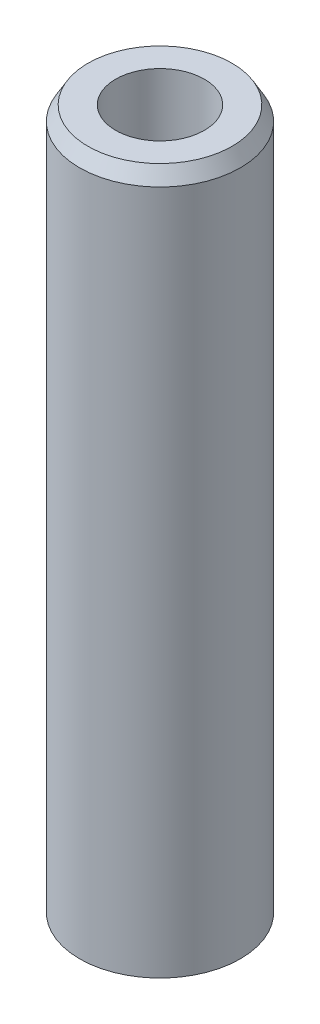
ISO-10303-21;
HEADER;
FILE_DESCRIPTION(('STEP AP214'),'2;1');
FILE_NAME('part.step','',(''),(''),'','','');
FILE_SCHEMA(('AUTOMOTIVE_DESIGN { 1 0 10303 214 1 1 1 1 }'));
ENDSEC;
DATA;
#1=APPLICATION_CONTEXT('core data for automotive mechanical design processes');
#2=APPLICATION_PROTOCOL_DEFINITION('international standard','automotive_design',2000,#1);
#3=PRODUCT_CONTEXT('',#1,'mechanical');
#4=PRODUCT('Part','Part','',(#3));
#5=PRODUCT_RELATED_PRODUCT_CATEGORY('part','',(#4));
#6=PRODUCT_DEFINITION_FORMATION('','',#4);
#7=PRODUCT_DEFINITION_CONTEXT('part definition',#1,'design');
#8=PRODUCT_DEFINITION('design','',#6,#7);
#9=PRODUCT_DEFINITION_SHAPE('','',#8);
#10=(LENGTH_UNIT() NAMED_UNIT(*) SI_UNIT(.MILLI.,.METRE.));
#11=(NAMED_UNIT(*) PLANE_ANGLE_UNIT() SI_UNIT($,.RADIAN.));
#12=(NAMED_UNIT(*) SI_UNIT($,.STERADIAN.) SOLID_ANGLE_UNIT());
#13=UNCERTAINTY_MEASURE_WITH_UNIT(LENGTH_MEASURE(1.E-05),#10,'distance_accuracy_value','');
#14=(GEOMETRIC_REPRESENTATION_CONTEXT(3) GLOBAL_UNCERTAINTY_ASSIGNED_CONTEXT((#13)) GLOBAL_UNIT_ASSIGNED_CONTEXT((#10,
#11,#12)) REPRESENTATION_CONTEXT('',''));
#15=CARTESIAN_POINT('',(0.,0.,0.));
#16=DIRECTION('',(0.,0.,1.));
#17=DIRECTION('',(1.,0.,0.));
#18=AXIS2_PLACEMENT_3D('',#15,#16,#17);
#19=CARTESIAN_POINT('',(0.,110.078650768655,0.));
#20=DIRECTION('',(0.,-1.,0.));
#21=DIRECTION('',(0.,0.,-1.));
#22=AXIS2_PLACEMENT_3D('',#19,#20,#21);
#23=CYLINDRICAL_SURFACE('',#22,12.5);
#24=CARTESIAN_POINT('',(0.,107.832440555177,0.));
#25=DIRECTION('',(0.,1.,0.));
#26=DIRECTION('',(0.,0.,1.));
#27=AXIS2_PLACEMENT_3D('',#24,#25,#26);
#28=CIRCLE('',#27,12.5);
#29=CARTESIAN_POINT('',(0.,107.832440555177,-12.5));
#30=VERTEX_POINT('',#29);
#31=EDGE_CURVE('E50',#30,#30,#28,.F.);
#32=CARTESIAN_POINT('',(0.,1.2968500714078,0.));
#33=DIRECTION('',(0.,1.,0.));
#34=DIRECTION('',(0.,0.,1.));
#35=AXIS2_PLACEMENT_3D('',#32,#33,#34);
#36=CIRCLE('',#35,12.5);
#37=CARTESIAN_POINT('',(0.,1.2968500714078,-12.5));
#38=VERTEX_POINT('',#37);
#39=EDGE_CURVE('E51',#38,#38,#36,.T.);
#40=CARTESIAN_POINT('',(0.,107.832440555177,-12.5));
#41=CARTESIAN_POINT('',(0.,106.722694820972,-12.5));
#42=CARTESIAN_POINT('',(0.,105.612949086766,-12.5));
#43=CARTESIAN_POINT('',(0.,103.393457618354,-12.5));
#44=CARTESIAN_POINT('',(0.,102.283711884148,-12.5));
#45=CARTESIAN_POINT('',(0.,100.064220415736,-12.5));
#46=CARTESIAN_POINT('',(0.,98.95447468153,-12.5));
#47=CARTESIAN_POINT('',(0.,96.7349832131182,-12.5));
#48=CARTESIAN_POINT('',(0.,95.6252374789122,-12.5));
#49=CARTESIAN_POINT('',(0.,93.4057460105004,-12.5));
#50=CARTESIAN_POINT('',(0.,92.2960002762944,-12.5));
#51=CARTESIAN_POINT('',(0.,90.0765088078825,-12.5));
#52=CARTESIAN_POINT('',(0.,88.9667630736766,-12.5));
#53=CARTESIAN_POINT('',(0.,86.7472716052647,-12.5));
#54=CARTESIAN_POINT('',(0.,85.6375258710588,-12.5));
#55=CARTESIAN_POINT('',(0.,83.418034402647,-12.5));
#56=CARTESIAN_POINT('',(0.,82.308288668441,-12.5));
#57=CARTESIAN_POINT('',(0.,80.0887972000291,-12.5));
#58=CARTESIAN_POINT('',(0.,78.9790514658232,-12.5));
#59=CARTESIAN_POINT('',(0.,76.7595599974113,-12.5));
#60=CARTESIAN_POINT('',(0.,75.6498142632054,-12.5));
#61=CARTESIAN_POINT('',(0.,73.4303227947935,-12.5));
#62=CARTESIAN_POINT('',(0.,72.3205770605876,-12.5));
#63=CARTESIAN_POINT('',(0.,70.1010855921757,-12.5));
#64=CARTESIAN_POINT('',(0.,68.9913398579698,-12.5));
#65=CARTESIAN_POINT('',(0.,66.7718483895579,-12.5));
#66=CARTESIAN_POINT('',(0.,65.662102655352,-12.5));
#67=CARTESIAN_POINT('',(0.,63.4426111869401,-12.5));
#68=CARTESIAN_POINT('',(0.,62.3328654527342,-12.5));
#69=CARTESIAN_POINT('',(0.,60.1133739843223,-12.5));
#70=CARTESIAN_POINT('',(0.,59.0036282501164,-12.5));
#71=CARTESIAN_POINT('',(0.,56.7841367817045,-12.5));
#72=CARTESIAN_POINT('',(0.,55.6743910474986,-12.5));
#73=CARTESIAN_POINT('',(0.,53.4548995790867,-12.5));
#74=CARTESIAN_POINT('',(0.,52.3451538448808,-12.5));
#75=CARTESIAN_POINT('',(0.,50.1256623764689,-12.5));
#76=CARTESIAN_POINT('',(0.,49.015916642263,-12.5));
#77=CARTESIAN_POINT('',(0.,46.7964251738511,-12.5));
#78=CARTESIAN_POINT('',(0.,45.6866794396452,-12.5));
#79=CARTESIAN_POINT('',(0.,43.4671879712333,-12.5));
#80=CARTESIAN_POINT('',(0.,42.3574422370274,-12.5));
#81=CARTESIAN_POINT('',(0.,40.1379507686155,-12.5));
#82=CARTESIAN_POINT('',(0.,39.0282050344096,-12.5));
#83=CARTESIAN_POINT('',(0.,36.8087135659977,-12.5));
#84=CARTESIAN_POINT('',(0.,35.6989678317918,-12.5));
#85=CARTESIAN_POINT('',(0.,33.4794763633799,-12.5));
#86=CARTESIAN_POINT('',(0.,32.369730629174,-12.5));
#87=CARTESIAN_POINT('',(0.,30.1502391607621,-12.5));
#88=CARTESIAN_POINT('',(0.,29.0404934265562,-12.5));
#89=CARTESIAN_POINT('',(0.,26.8210019581443,-12.5));
#90=CARTESIAN_POINT('',(0.,25.7112562239384,-12.5));
#91=CARTESIAN_POINT('',(0.,23.4917647555265,-12.5));
#92=CARTESIAN_POINT('',(0.,22.3820190213206,-12.5));
#93=CARTESIAN_POINT('',(0.,20.1625275529087,-12.5));
#94=CARTESIAN_POINT('',(0.,19.0527818187027,-12.5));
#95=CARTESIAN_POINT('',(0.,16.8332903502909,-12.5));
#96=CARTESIAN_POINT('',(0.,15.7235446160849,-12.5));
#97=CARTESIAN_POINT('',(0.,13.5040531476731,-12.5));
#98=CARTESIAN_POINT('',(0.,12.3943074134671,-12.5));
#99=CARTESIAN_POINT('',(0.,10.1748159450553,-12.5));
#100=CARTESIAN_POINT('',(0.,9.06507021084935,-12.5));
#101=CARTESIAN_POINT('',(0.,6.84557874243748,-12.5));
#102=CARTESIAN_POINT('',(0.,5.73583300823153,-12.5));
#103=CARTESIAN_POINT('',(0.,3.51634153981966,-12.5));
#104=CARTESIAN_POINT('',(0.,2.40659580561373,-12.5));
#105=CARTESIAN_POINT('',(0.,1.2968500714078,-12.5));
#106=B_SPLINE_CURVE_WITH_KNOTS('',3,(#40,#41,#42,#43,#44,#45,#46,#47,#48,#49,#50,#51,#52,#53,
#54,#55,#56,#57,#58,#59,#60,#61,#62,#63,#64,#65,#66,#67,#68,#69,#70,#71,#72,#73,#74,#75,#76,#77,
#78,#79,#80,#81,#82,#83,#84,#85,#86,#87,#88,#89,#90,#91,#92,#93,#94,#95,#96,#97,#98,#99,#100,
#101,#102,#103,#104,#105),.UNSPECIFIED.,.F.,.F.,(4,2,2,2,2,2,2,2,2,2,2,2,2,2,2,2,2,2,2,2,2,2,2,
2,2,2,2,2,2,2,2,2,4),(0.,3.32923720261781,6.65847440523561,9.98771160785342,13.3169488104712,
16.646186013089,19.9754232157068,23.3046604183246,26.6338976209424,29.9631348235602,
33.292372026178,36.6216092287958,39.9508464314136,43.2800836340314,46.6093208366492,
49.9385580392671,53.2677952418849,56.5970324445027,59.9262696471205,63.2555068497383,
66.5847440523561,69.9139812549739,73.2432184575917,76.5724556602095,79.9016928628273,
83.2309300654451,86.5601672680629,89.8894044706807,93.2186416732985,96.5478788759163,
99.8771160785341,103.206353281152,106.53559048377),.UNSPECIFIED.);
#107=EDGE_CURVE('BSEAM39',#30,#38,#106,.T.);
#108=ORIENTED_EDGE('',*,*,#31,.T.);
#109=ORIENTED_EDGE('',*,*,#39,.T.);
#110=ORIENTED_EDGE('',*,*,#107,.T.);
#111=ORIENTED_EDGE('',*,*,#107,.F.);
#112=EDGE_LOOP('',(#108,#110,#109,#111));
#113=FACE_BOUND('',#112,.T.);
#114=ADVANCED_FACE('F39',(#113),#23,.T.);
#115=CARTESIAN_POINT('',(0.,110.078650768655,0.));
#116=DIRECTION('',(0.,1.,0.));
#117=DIRECTION('',(0.,0.,1.));
#118=AXIS2_PLACEMENT_3D('',#115,#116,#117);
#119=PLANE('',#118);
#120=CARTESIAN_POINT('',(0.,110.078650768655,0.));
#121=DIRECTION('',(0.,1.,0.));
#122=DIRECTION('',(0.,0.,1.));
#123=AXIS2_PLACEMENT_3D('',#120,#121,#122);
#124=CIRCLE('',#123,11.2031499285923);
#125=CARTESIAN_POINT('',(0.,110.078650768655,-11.2031499285923));
#126=VERTEX_POINT('',#125);
#127=EDGE_CURVE('E54',#126,#126,#124,.T.);
#128=ORIENTED_EDGE('',*,*,#127,.T.);
#129=EDGE_LOOP('',(#128));
#130=FACE_BOUND('',#129,.T.);
#131=CARTESIAN_POINT('',(0.,110.078650768655,0.));
#132=DIRECTION('',(0.,1.,0.));
#133=DIRECTION('',(0.,0.,1.));
#134=AXIS2_PLACEMENT_3D('',#131,#132,#133);
#135=CIRCLE('',#134,6.89995657612535);
#136=CARTESIAN_POINT('',(0.,110.078650768655,-6.89995657612535));
#137=VERTEX_POINT('',#136);
#138=EDGE_CURVE('E58',#137,#137,#135,.T.);
#139=ORIENTED_EDGE('',*,*,#138,.F.);
#140=EDGE_LOOP('',(#139));
#141=FACE_BOUND('',#140,.T.);
#142=ADVANCED_FACE('F69',(#130,#141),#119,.T.);
#143=CARTESIAN_POINT('',(0.,0.,0.));
#144=DIRECTION('',(0.,1.,0.));
#145=DIRECTION('',(0.,0.,1.));
#146=AXIS2_PLACEMENT_3D('',#143,#144,#145);
#147=PLANE('',#146);
#148=CARTESIAN_POINT('',(0.,0.,0.));
#149=DIRECTION('',(0.,1.,0.));
#150=DIRECTION('',(0.,0.,1.));
#151=AXIS2_PLACEMENT_3D('',#148,#149,#150);
#152=CIRCLE('',#151,10.2537897865223);
#153=CARTESIAN_POINT('',(0.,0.,10.2537897865223));
#154=VERTEX_POINT('',#153);
#155=EDGE_CURVE('E10',#154,#154,#152,.F.);
#156=ORIENTED_EDGE('',*,*,#155,.T.);
#157=EDGE_LOOP('',(#156));
#158=FACE_BOUND('',#157,.T.);
#159=CARTESIAN_POINT('',(0.,0.,0.));
#160=DIRECTION('',(0.,1.,0.));
#161=DIRECTION('',(0.,0.,1.));
#162=AXIS2_PLACEMENT_3D('',#159,#160,#161);
#163=CIRCLE('',#162,6.89995657612535);
#164=CARTESIAN_POINT('',(0.,0.,-6.89995657612535));
#165=VERTEX_POINT('',#164);
#166=EDGE_CURVE('E63',#165,#165,#163,.T.);
#167=ORIENTED_EDGE('',*,*,#166,.T.);
#168=EDGE_LOOP('',(#167));
#169=FACE_BOUND('',#168,.T.);
#170=ADVANCED_FACE('F75',(#158,#169),#147,.F.);
#171=CARTESIAN_POINT('',(0.,110.078650768655,0.));
#172=DIRECTION('',(0.,-1.,0.));
#173=DIRECTION('',(0.,0.,-1.));
#174=AXIS2_PLACEMENT_3D('',#171,#172,#173);
#175=CYLINDRICAL_SURFACE('',#174,6.89995657612535);
#176=CARTESIAN_POINT('',(0.,110.078650768655,-6.89995657612535));
#177=CARTESIAN_POINT('',(0.,108.931998156481,-6.89995657612535));
#178=CARTESIAN_POINT('',(0.,107.785345544308,-6.89995657612535));
#179=CARTESIAN_POINT('',(0.,105.492040319961,-6.89995657612535));
#180=CARTESIAN_POINT('',(0.,104.345387707787,-6.89995657612535));
#181=CARTESIAN_POINT('',(0.,102.052082483441,-6.89995657612535));
#182=CARTESIAN_POINT('',(0.,100.905429871267,-6.89995657612535));
#183=CARTESIAN_POINT('',(0.,98.61212464692,-6.89995657612535));
#184=CARTESIAN_POINT('',(0.,97.4654720347466,-6.89995657612535));
#185=CARTESIAN_POINT('',(0.,95.1721668103996,-6.89995657612535));
#186=CARTESIAN_POINT('',(0.,94.0255141982261,-6.89995657612535));
#187=CARTESIAN_POINT('',(0.,91.7322089738791,-6.89995657612535));
#188=CARTESIAN_POINT('',(0.,90.5855563617056,-6.89995657612535));
#189=CARTESIAN_POINT('',(0.,88.2922511373586,-6.89995657612535));
#190=CARTESIAN_POINT('',(0.,87.1455985251852,-6.89995657612535));
#191=CARTESIAN_POINT('',(0.,84.8522933008382,-6.89995657612535));
#192=CARTESIAN_POINT('',(0.,83.7056406886647,-6.89995657612535));
#193=CARTESIAN_POINT('',(0.,81.4123354643177,-6.89995657612535));
#194=CARTESIAN_POINT('',(0.,80.2656828521442,-6.89995657612535));
#195=CARTESIAN_POINT('',(0.,77.9723776277972,-6.89995657612535));
#196=CARTESIAN_POINT('',(0.,76.8257250156237,-6.89995657612535));
#197=CARTESIAN_POINT('',(0.,74.5324197912768,-6.89995657612535));
#198=CARTESIAN_POINT('',(0.,73.3857671791033,-6.89995657612535));
#199=CARTESIAN_POINT('',(0.,71.0924619547563,-6.89995657612535));
#200=CARTESIAN_POINT('',(0.,69.9458093425828,-6.89995657612535));
#201=CARTESIAN_POINT('',(0.,67.6525041182358,-6.89995657612535));
#202=CARTESIAN_POINT('',(0.,66.5058515060624,-6.89995657612535));
#203=CARTESIAN_POINT('',(0.,64.2125462817154,-6.89995657612535));
#204=CARTESIAN_POINT('',(0.,63.0658936695419,-6.89995657612535));
#205=CARTESIAN_POINT('',(0.,60.7725884451949,-6.89995657612535));
#206=CARTESIAN_POINT('',(0.,59.6259358330214,-6.89995657612535));
#207=CARTESIAN_POINT('',(0.,57.3326306086744,-6.89995657612535));
#208=CARTESIAN_POINT('',(0.,56.185977996501,-6.89995657612535));
#209=CARTESIAN_POINT('',(0.,53.892672772154,-6.89995657612535));
#210=CARTESIAN_POINT('',(0.,52.7460201599805,-6.89995657612535));
#211=CARTESIAN_POINT('',(0.,50.4527149356335,-6.89995657612535));
#212=CARTESIAN_POINT('',(0.,49.30606232346,-6.89995657612535));
#213=CARTESIAN_POINT('',(0.,47.012757099113,-6.89995657612535));
#214=CARTESIAN_POINT('',(0.,45.8661044869396,-6.89995657612535));
#215=CARTESIAN_POINT('',(0.,43.5727992625926,-6.89995657612535));
#216=CARTESIAN_POINT('',(0.,42.4261466504191,-6.89995657612535));
#217=CARTESIAN_POINT('',(0.,40.1328414260721,-6.89995657612535));
#218=CARTESIAN_POINT('',(0.,38.9861888138986,-6.89995657612535));
#219=CARTESIAN_POINT('',(0.,36.6928835895516,-6.89995657612535));
#220=CARTESIAN_POINT('',(0.,35.5462309773782,-6.89995657612535));
#221=CARTESIAN_POINT('',(0.,33.2529257530312,-6.89995657612535));
#222=CARTESIAN_POINT('',(0.,32.1062731408577,-6.89995657612535));
#223=CARTESIAN_POINT('',(0.,29.8129679165107,-6.89995657612535));
#224=CARTESIAN_POINT('',(0.,28.6663153043372,-6.89995657612535));
#225=CARTESIAN_POINT('',(0.,26.3730100799902,-6.89995657612535));
#226=CARTESIAN_POINT('',(0.,25.2263574678167,-6.89995657612535));
#227=CARTESIAN_POINT('',(0.,22.9330522434698,-6.89995657612535));
#228=CARTESIAN_POINT('',(0.,21.7863996312963,-6.89995657612535));
#229=CARTESIAN_POINT('',(0.,19.4930944069493,-6.89995657612535));
#230=CARTESIAN_POINT('',(0.,18.3464417947758,-6.89995657612535));
#231=CARTESIAN_POINT('',(0.,16.0531365704288,-6.89995657612535));
#232=CARTESIAN_POINT('',(0.,14.9064839582553,-6.89995657612535));
#233=CARTESIAN_POINT('',(0.,12.6131787339084,-6.89995657612535));
#234=CARTESIAN_POINT('',(0.,11.4665261217349,-6.89995657612535));
#235=CARTESIAN_POINT('',(0.,9.1732208973879,-6.89995657612535));
#236=CARTESIAN_POINT('',(0.,8.02656828521441,-6.89995657612535));
#237=CARTESIAN_POINT('',(0.,5.73326306086744,-6.89995657612535));
#238=CARTESIAN_POINT('',(0.,4.58661044869395,-6.89995657612535));
#239=CARTESIAN_POINT('',(0.,2.29330522434697,-6.89995657612535));
#240=CARTESIAN_POINT('',(0.,1.14665261217348,-6.89995657612535));
#241=CARTESIAN_POINT('',(0.,0.,-6.89995657612535));
#242=B_SPLINE_CURVE_WITH_KNOTS('',3,(#176,#177,#178,#179,#180,#181,#182,#183,#184,#185,#186,
#187,#188,#189,#190,#191,#192,#193,#194,#195,#196,#197,#198,#199,#200,#201,#202,#203,#204,#205,
#206,#207,#208,#209,#210,#211,#212,#213,#214,#215,#216,#217,#218,#219,#220,#221,#222,#223,#224,
#225,#226,#227,#228,#229,#230,#231,#232,#233,#234,#235,#236,#237,#238,#239,#240,#241),
.UNSPECIFIED.,.F.,.F.,(4,2,2,2,2,2,2,2,2,2,2,2,2,2,2,2,2,2,2,2,2,2,2,2,2,2,2,2,2,2,2,2,4),(0.,
3.43995783652047,6.87991567304094,10.3198735095614,13.7598313460819,17.1997891826023,
20.6397470191228,24.0797048556433,27.5196626921637,30.9596205286842,34.3995783652047,
37.8395362017251,41.2794940382456,44.7194518747661,48.1594097112865,51.599367547807,
55.0393253843275,58.479283220848,61.9192410573684,65.3591988938889,68.7991567304094,
72.2391145669298,75.6790724034503,79.1190302399707,82.5589880764912,85.9989459130117,
89.4389037495322,92.8788615860526,96.3188194225731,99.7587772590936,103.198735095614,
106.638692932134,110.078650768655),.UNSPECIFIED.);
#243=EDGE_CURVE('BSEAM70',#137,#165,#242,.T.);
#244=ORIENTED_EDGE('',*,*,#138,.T.);
#245=ORIENTED_EDGE('',*,*,#166,.F.);
#246=ORIENTED_EDGE('',*,*,#243,.T.);
#247=ORIENTED_EDGE('',*,*,#243,.F.);
#248=EDGE_LOOP('',(#244,#246,#245,#247));
#249=FACE_BOUND('',#248,.T.);
#250=ADVANCED_FACE('F70',(#249),#175,.F.);
#251=CARTESIAN_POINT('',(0.,110.078650768655,0.));
#252=DIRECTION('',(0.,-1.,0.));
#253=DIRECTION('',(0.,0.,-1.));
#254=AXIS2_PLACEMENT_3D('',#251,#252,#253);
#255=CONICAL_SURFACE('',#254,11.2031499285923,0.523598775598296);
#256=CARTESIAN_POINT('',(0.,107.832440555177,-12.5));
#257=CARTESIAN_POINT('',(0.,107.855838578235,-12.4864911450895));
#258=CARTESIAN_POINT('',(0.,107.879236601292,-12.472982290179));
#259=CARTESIAN_POINT('',(0.,107.926032647406,-12.445964580358));
#260=CARTESIAN_POINT('',(0.,107.949430670463,-12.4324557254475));
#261=CARTESIAN_POINT('',(0.,107.996226716577,-12.4054380156265));
#262=CARTESIAN_POINT('',(0.,108.019624739634,-12.391929160716));
#263=CARTESIAN_POINT('',(0.,108.066420785748,-12.364911450895));
#264=CARTESIAN_POINT('',(0.,108.089818808805,-12.3514025959845));
#265=CARTESIAN_POINT('',(0.,108.136614854919,-12.3243848861635));
#266=CARTESIAN_POINT('',(0.,108.160012877976,-12.3108760312531));
#267=CARTESIAN_POINT('',(0.,108.20680892409,-12.2838583214321));
#268=CARTESIAN_POINT('',(0.,108.230206947147,-12.2703494665216));
#269=CARTESIAN_POINT('',(0.,108.277002993262,-12.2433317567006));
#270=CARTESIAN_POINT('',(0.,108.300401016319,-12.2298229017901));
#271=CARTESIAN_POINT('',(0.,108.347197062433,-12.2028051919691));
#272=CARTESIAN_POINT('',(0.,108.37059508549,-12.1892963370586));
#273=CARTESIAN_POINT('',(0.,108.417391131604,-12.1622786272376));
#274=CARTESIAN_POINT('',(0.,108.440789154661,-12.1487697723271));
#275=CARTESIAN_POINT('',(0.,108.487585200775,-12.1217520625061));
#276=CARTESIAN_POINT('',(0.,108.510983223832,-12.1082432075956));
#277=CARTESIAN_POINT('',(0.,108.557779269946,-12.0812254977746));
#278=CARTESIAN_POINT('',(0.,108.581177293003,-12.0677166428641));
#279=CARTESIAN_POINT('',(0.,108.627973339117,-12.0406989330431));
#280=CARTESIAN_POINT('',(0.,108.651371362174,-12.0271900781326));
#281=CARTESIAN_POINT('',(0.,108.698167408289,-12.0001723683116));
#282=CARTESIAN_POINT('',(0.,108.721565431346,-11.9866635134011));
#283=CARTESIAN_POINT('',(0.,108.76836147746,-11.9596458035801));
#284=CARTESIAN_POINT('',(0.,108.791759500517,-11.9461369486696));
#285=CARTESIAN_POINT('',(0.,108.838555546631,-11.9191192388486));
#286=CARTESIAN_POINT('',(0.,108.861953569688,-11.9056103839382));
#287=CARTESIAN_POINT('',(0.,108.908749615802,-11.8785926741172));
#288=CARTESIAN_POINT('',(0.,108.932147638859,-11.8650838192067));
#289=CARTESIAN_POINT('',(0.,108.978943684973,-11.8380661093857));
#290=CARTESIAN_POINT('',(0.,109.00234170803,-11.8245572544752));
#291=CARTESIAN_POINT('',(0.,109.049137754144,-11.7975395446542));
#292=CARTESIAN_POINT('',(0.,109.072535777201,-11.7840306897437));
#293=CARTESIAN_POINT('',(0.,109.119331823316,-11.7570129799227));
#294=CARTESIAN_POINT('',(0.,109.142729846373,-11.7435041250122));
#295=CARTESIAN_POINT('',(0.,109.189525892487,-11.7164864151912));
#296=CARTESIAN_POINT('',(0.,109.212923915544,-11.7029775602807));
#297=CARTESIAN_POINT('',(0.,109.259719961658,-11.6759598504597));
#298=CARTESIAN_POINT('',(0.,109.283117984715,-11.6624509955492));
#299=CARTESIAN_POINT('',(0.,109.329914030829,-11.6354332857282));
#300=CARTESIAN_POINT('',(0.,109.353312053886,-11.6219244308177));
#301=CARTESIAN_POINT('',(0.,109.4001081,-11.5949067209967));
#302=CARTESIAN_POINT('',(0.,109.423506123057,-11.5813978660862));
#303=CARTESIAN_POINT('',(0.,109.470302169171,-11.5543801562652));
#304=CARTESIAN_POINT('',(0.,109.493700192229,-11.5408713013547));
#305=CARTESIAN_POINT('',(0.,109.540496238343,-11.5138535915337));
#306=CARTESIAN_POINT('',(0.,109.5638942614,-11.5003447366233));
#307=CARTESIAN_POINT('',(0.,109.610690307514,-11.4733270268023));
#308=CARTESIAN_POINT('',(0.,109.634088330571,-11.4598181718918));
#309=CARTESIAN_POINT('',(0.,109.680884376685,-11.4328004620708));
#310=CARTESIAN_POINT('',(0.,109.704282399742,-11.4192916071603));
#311=CARTESIAN_POINT('',(0.,109.751078445856,-11.3922738973393));
#312=CARTESIAN_POINT('',(0.,109.774476468913,-11.3787650424288));
#313=CARTESIAN_POINT('',(0.,109.821272515027,-11.3517473326078));
#314=CARTESIAN_POINT('',(0.,109.844670538084,-11.3382384776973));
#315=CARTESIAN_POINT('',(0.,109.891466584198,-11.3112207678763));
#316=CARTESIAN_POINT('',(0.,109.914864607256,-11.2977119129658));
#317=CARTESIAN_POINT('',(0.,109.96166065337,-11.2706942031448));
#318=CARTESIAN_POINT('',(0.,109.985058676427,-11.2571853482343));
#319=CARTESIAN_POINT('',(0.,110.031854722541,-11.2301676384133));
#320=CARTESIAN_POINT('',(0.,110.055252745598,-11.2166587835028));
#321=CARTESIAN_POINT('',(0.,110.078650768655,-11.2031499285923));
#322=B_SPLINE_CURVE_WITH_KNOTS('',3,(#256,#257,#258,#259,#260,#261,#262,#263,#264,#265,#266,
#267,#268,#269,#270,#271,#272,#273,#274,#275,#276,#277,#278,#279,#280,#281,#282,#283,#284,#285,
#286,#287,#288,#289,#290,#291,#292,#293,#294,#295,#296,#297,#298,#299,#300,#301,#302,#303,#304,
#305,#306,#307,#308,#309,#310,#311,#312,#313,#314,#315,#316,#317,#318,#319,#320,#321),
.UNSPECIFIED.,.F.,.F.,(4,2,2,2,2,2,2,2,2,2,2,2,2,2,2,2,2,2,2,2,2,2,2,2,2,2,2,2,2,2,2,2,4),(0.,
0.0810531294629754,0.162106258925951,0.243159388388938,0.324212517851914,0.405265647314901,
0.486318776777876,0.567371906240852,0.648425035703839,0.729478165166815,0.810531294629803,
0.891584424092778,0.972637553555754,1.05369068301874,1.13474381248172,1.2157969419447,
1.29685007140768,1.37790320087065,1.45895633033364,1.54000945979662,1.62106258925961,
1.70211571872258,1.78316884818556,1.86422197764854,1.94527510711152,2.02632823657451,
2.10738136603748,2.18843449550046,2.26948762496345,2.35054075442642,2.43159388388941,
2.51264701335238,2.59370014281537),.UNSPECIFIED.);
#323=EDGE_CURVE('BSEAM81',#30,#126,#322,.T.);
#324=ORIENTED_EDGE('',*,*,#31,.F.);
#325=ORIENTED_EDGE('',*,*,#127,.F.);
#326=ORIENTED_EDGE('',*,*,#323,.T.);
#327=ORIENTED_EDGE('',*,*,#323,.F.);
#328=EDGE_LOOP('',(#324,#326,#325,#327));
#329=FACE_BOUND('',#328,.T.);
#330=ADVANCED_FACE('F81',(#329),#255,.T.);
#331=CARTESIAN_POINT('',(0.,1.2968500714078,0.));
#332=DIRECTION('',(0.,1.,0.));
#333=DIRECTION('',(0.,0.,1.));
#334=AXIS2_PLACEMENT_3D('',#331,#332,#333);
#335=CONICAL_SURFACE('',#334,12.5,1.0471975511966);
#336=ORIENTED_EDGE('',*,*,#155,.F.);
#337=EDGE_LOOP('',(#336));
#338=FACE_BOUND('',#337,.T.);
#339=ORIENTED_EDGE('',*,*,#39,.F.);
#340=EDGE_LOOP('',(#339));
#341=FACE_BOUND('',#340,.T.);
#342=ADVANCED_FACE('F45',(#338,#341),#335,.T.);
#343=CLOSED_SHELL('',(#114,#142,#170,#250,#330,#342));
#344=MANIFOLD_SOLID_BREP('B2',#343);
#345=ADVANCED_BREP_SHAPE_REPRESENTATION('',(#18,#344),#14);
#346=SHAPE_DEFINITION_REPRESENTATION(#9,#345);
ENDSEC;
END-ISO-10303-21;
